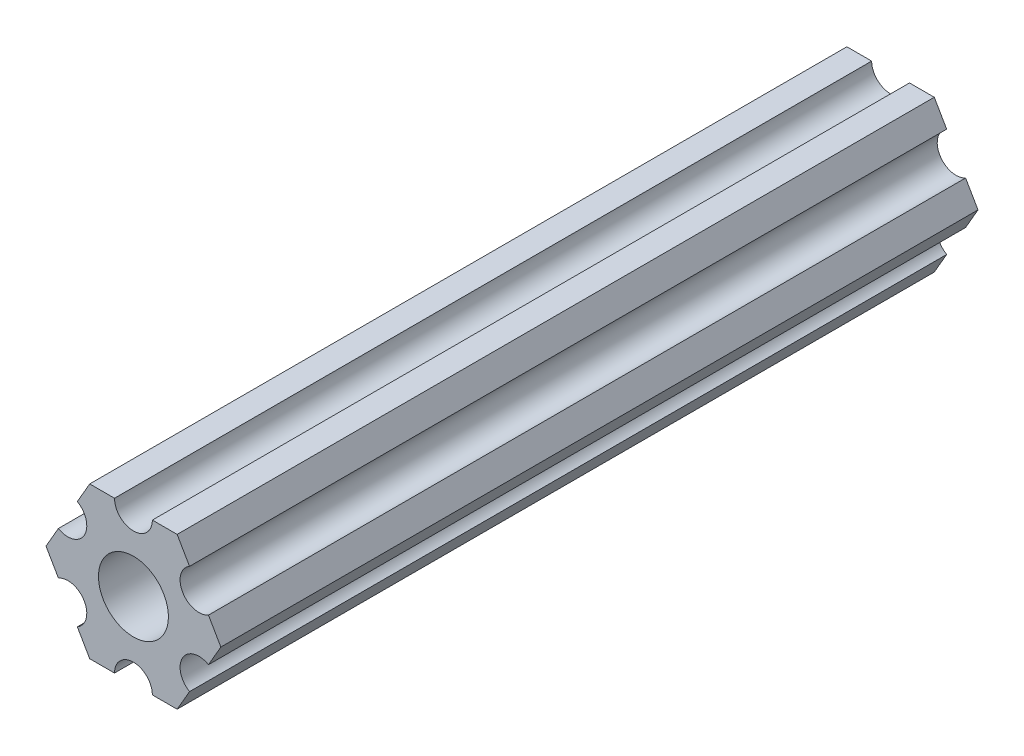
ISO-10303-21;
HEADER;
FILE_DESCRIPTION(('STEP AP214'),'2;1');
FILE_NAME('part.step','',(''),(''),'','','');
FILE_SCHEMA(('AUTOMOTIVE_DESIGN { 1 0 10303 214 1 1 1 1 }'));
ENDSEC;
DATA;
#1=APPLICATION_CONTEXT('core data for automotive mechanical design processes');
#2=APPLICATION_PROTOCOL_DEFINITION('international standard','automotive_design',2000,#1);
#3=PRODUCT_CONTEXT('',#1,'mechanical');
#4=PRODUCT('Part','Part','',(#3));
#5=PRODUCT_RELATED_PRODUCT_CATEGORY('part','',(#4));
#6=PRODUCT_DEFINITION_FORMATION('','',#4);
#7=PRODUCT_DEFINITION_CONTEXT('part definition',#1,'design');
#8=PRODUCT_DEFINITION('design','',#6,#7);
#9=PRODUCT_DEFINITION_SHAPE('','',#8);
#10=(LENGTH_UNIT() NAMED_UNIT(*) SI_UNIT(.MILLI.,.METRE.));
#11=(NAMED_UNIT(*) PLANE_ANGLE_UNIT() SI_UNIT($,.RADIAN.));
#12=(NAMED_UNIT(*) SI_UNIT($,.STERADIAN.) SOLID_ANGLE_UNIT());
#13=UNCERTAINTY_MEASURE_WITH_UNIT(LENGTH_MEASURE(1.E-05),#10,'distance_accuracy_value','');
#14=(GEOMETRIC_REPRESENTATION_CONTEXT(3) GLOBAL_UNCERTAINTY_ASSIGNED_CONTEXT((#13)) GLOBAL_UNIT_ASSIGNED_CONTEXT((#10,
#11,#12)) REPRESENTATION_CONTEXT('',''));
#15=CARTESIAN_POINT('',(0.,0.,0.));
#16=DIRECTION('',(0.,0.,1.));
#17=DIRECTION('',(1.,0.,0.));
#18=AXIS2_PLACEMENT_3D('',#15,#16,#17);
#19=CARTESIAN_POINT('',(6.29301142309098,-1.80018429024546,304.8));
#20=DIRECTION('',(-0.866025434075723,0.499999947533953,0.));
#21=DIRECTION('',(-0.499999947533953,-0.866025434075723,0.));
#22=AXIS2_PLACEMENT_3D('',#19,#20,#21);
#23=PLANE('',#22);
#24=DIRECTION('',(0.,0.,1.));
#25=VECTOR('',#24,1.);
#26=CARTESIAN_POINT('',(6.29301142309098,-1.80018429024547,304.8));
#27=LINE('',#26,#25);
#28=CARTESIAN_POINT('',(6.29301142309098,-1.80018429024547,63.5));
#29=VERTEX_POINT('',#28);
#30=CARTESIAN_POINT('',(6.29301142309098,-1.80018429024547,0.));
#31=VERTEX_POINT('',#30);
#32=EDGE_CURVE('E231',#29,#31,#27,.F.);
#33=ORIENTED_EDGE('',*,*,#32,.T.);
#34=DIRECTION('',(0.500000040068746,0.866025380650736,0.));
#35=VECTOR('',#34,1.);
#36=CARTESIAN_POINT('',(6.29301142309098,-1.80018429024546,0.));
#37=LINE('',#36,#35);
#38=CARTESIAN_POINT('',(7.33234841870827,0.,0.));
#39=VERTEX_POINT('',#38);
#40=EDGE_CURVE('E142',#31,#39,#37,.T.);
#41=ORIENTED_EDGE('',*,*,#40,.T.);
#42=DIRECTION('',(0.,0.,1.));
#43=VECTOR('',#42,1.);
#44=CARTESIAN_POINT('',(7.33234841870827,0.,304.8));
#45=LINE('',#44,#43);
#46=CARTESIAN_POINT('',(7.33234841870827,0.,63.5));
#47=VERTEX_POINT('',#46);
#48=EDGE_CURVE('E146',#39,#47,#45,.T.);
#49=ORIENTED_EDGE('',*,*,#48,.T.);
#50=DIRECTION('',(0.500000040068743,0.866025380650737,0.));
#51=VECTOR('',#50,1.);
#52=CARTESIAN_POINT('',(6.29301142309098,-1.80018429024547,63.5));
#53=LINE('',#52,#51);
#54=EDGE_CURVE('E133',#29,#47,#53,.T.);
#55=ORIENTED_EDGE('',*,*,#54,.F.);
#56=EDGE_LOOP('',(#33,#41,#49,#55));
#57=FACE_BOUND('',#56,.T.);
#58=ADVANCED_FACE('F17',(#57),#23,.F.);
#59=CARTESIAN_POINT('',(7.33234841870827,0.,304.8));
#60=DIRECTION('',(-0.866025373493145,-0.500000052466057,0.));
#61=DIRECTION('',(0.500000052466057,-0.866025373493145,0.));
#62=AXIS2_PLACEMENT_3D('',#59,#60,#61);
#63=PLANE('',#62);
#64=ORIENTED_EDGE('',*,*,#48,.F.);
#65=DIRECTION('',(-0.499999959931286,0.86602542691812,0.));
#66=VECTOR('',#65,1.);
#67=CARTESIAN_POINT('',(7.33234841870827,0.,0.));
#68=LINE('',#67,#66);
#69=CARTESIAN_POINT('',(6.29301120497138,1.80018505273895,0.));
#70=VERTEX_POINT('',#69);
#71=EDGE_CURVE('E225',#39,#70,#68,.T.);
#72=ORIENTED_EDGE('',*,*,#71,.T.);
#73=DIRECTION('',(0.,0.,1.));
#74=VECTOR('',#73,1.);
#75=CARTESIAN_POINT('',(6.29301120497138,1.80018505273895,304.8));
#76=LINE('',#75,#74);
#77=CARTESIAN_POINT('',(6.29301120497138,1.80018505273895,63.5));
#78=VERTEX_POINT('',#77);
#79=EDGE_CURVE('E151',#70,#78,#76,.T.);
#80=ORIENTED_EDGE('',*,*,#79,.T.);
#81=DIRECTION('',(-0.499999959931286,0.86602542691812,0.));
#82=VECTOR('',#81,1.);
#83=CARTESIAN_POINT('',(7.33234841870827,0.,63.5));
#84=LINE('',#83,#82);
#85=EDGE_CURVE('E137',#47,#78,#84,.T.);
#86=ORIENTED_EDGE('',*,*,#85,.F.);
#87=EDGE_LOOP('',(#64,#72,#80,#86));
#88=FACE_BOUND('',#87,.T.);
#89=ADVANCED_FACE('F153',(#88),#63,.F.);
#90=CARTESIAN_POINT('',(5.49926112168156,3.17500033315934,304.8));
#91=DIRECTION('',(0.,0.,1.));
#92=DIRECTION('',(1.,0.,0.));
#93=AXIS2_PLACEMENT_3D('',#90,#91,#92);
#94=CYLINDRICAL_SURFACE('',#93,1.5875);
#95=ORIENTED_EDGE('',*,*,#79,.F.);
#96=CARTESIAN_POINT('',(5.49926112168156,3.17500033315934,0.));
#97=DIRECTION('',(0.,0.,1.));
#98=DIRECTION('',(1.,0.,0.));
#99=AXIS2_PLACEMENT_3D('',#96,#97,#98);
#100=CIRCLE('',#99,1.5875);
#101=CARTESIAN_POINT('',(4.70551103839172,4.54981561357972,0.));
#102=VERTEX_POINT('',#101);
#103=EDGE_CURVE('E222',#70,#102,#100,.F.);
#104=ORIENTED_EDGE('',*,*,#103,.T.);
#105=DIRECTION('',(0.,0.,1.));
#106=VECTOR('',#105,1.);
#107=CARTESIAN_POINT('',(4.70551103839172,4.54981561357972,304.8));
#108=LINE('',#107,#106);
#109=CARTESIAN_POINT('',(4.70551103839172,4.54981561357972,63.5));
#110=VERTEX_POINT('',#109);
#111=EDGE_CURVE('E275',#102,#110,#108,.T.);
#112=ORIENTED_EDGE('',*,*,#111,.T.);
#113=CARTESIAN_POINT('',(5.49926112168156,3.17500033315934,63.5));
#114=DIRECTION('',(0.,0.,1.));
#115=DIRECTION('',(1.,0.,0.));
#116=AXIS2_PLACEMENT_3D('',#113,#114,#115);
#117=CIRCLE('',#116,1.5875);
#118=EDGE_CURVE('E155',#78,#110,#117,.F.);
#119=ORIENTED_EDGE('',*,*,#118,.F.);
#120=EDGE_LOOP('',(#95,#104,#112,#119));
#121=FACE_BOUND('',#120,.T.);
#122=ADVANCED_FACE('F313',(#121),#94,.F.);
#123=CARTESIAN_POINT('',(4.70551103839172,4.54981561357972,304.8));
#124=DIRECTION('',(-0.866025373493151,-0.500000052466046,0.));
#125=DIRECTION('',(0.500000052466046,-0.866025373493151,0.));
#126=AXIS2_PLACEMENT_3D('',#123,#124,#125);
#127=PLANE('',#126);
#128=ORIENTED_EDGE('',*,*,#111,.F.);
#129=DIRECTION('',(-0.500000052466044,0.866025373493152,0.));
#130=VECTOR('',#129,1.);
#131=CARTESIAN_POINT('',(4.70551103839172,4.54981561357972,0.));
#132=LINE('',#131,#130);
#133=CARTESIAN_POINT('',(3.66617382465481,6.35000022210627,0.));
#134=VERTEX_POINT('',#133);
#135=EDGE_CURVE('E217',#102,#134,#132,.T.);
#136=ORIENTED_EDGE('',*,*,#135,.T.);
#137=DIRECTION('',(0.,0.,-1.));
#138=VECTOR('',#137,1.);
#139=CARTESIAN_POINT('',(3.66617382465481,6.35000022210627,304.8));
#140=LINE('',#139,#138);
#141=CARTESIAN_POINT('',(3.66617382465481,6.35000022210627,63.5));
#142=VERTEX_POINT('',#141);
#143=EDGE_CURVE('E127',#134,#142,#140,.F.);
#144=ORIENTED_EDGE('',*,*,#143,.T.);
#145=DIRECTION('',(-0.500000052466043,0.866025373493152,0.));
#146=VECTOR('',#145,1.);
#147=CARTESIAN_POINT('',(4.70551103839172,4.54981561357972,63.5));
#148=LINE('',#147,#146);
#149=EDGE_CURVE('E157',#110,#142,#148,.T.);
#150=ORIENTED_EDGE('',*,*,#149,.F.);
#151=EDGE_LOOP('',(#128,#136,#144,#150));
#152=FACE_BOUND('',#151,.T.);
#153=ADVANCED_FACE('F320',(#152),#127,.F.);
#154=CARTESIAN_POINT('',(3.66617382465481,6.35000022210627,304.8));
#155=DIRECTION('',(0.,-1.,0.));
#156=DIRECTION('',(0.,0.,-1.));
#157=AXIS2_PLACEMENT_3D('',#154,#155,#156);
#158=PLANE('',#157);
#159=ORIENTED_EDGE('',*,*,#143,.F.);
#160=DIRECTION('',(1.,0.,0.));
#161=VECTOR('',#160,1.);
#162=CARTESIAN_POINT('',(5.49926112168156,6.35000022210627,0.));
#163=LINE('',#162,#161);
#164=CARTESIAN_POINT('',(1.58749980765036,6.35000022210627,0.));
#165=VERTEX_POINT('',#164);
#166=EDGE_CURVE('E215',#134,#165,#163,.F.);
#167=ORIENTED_EDGE('',*,*,#166,.T.);
#168=DIRECTION('',(0.,0.,-1.));
#169=VECTOR('',#168,1.);
#170=CARTESIAN_POINT('',(1.58749961530074,6.35000022210627,304.8));
#171=LINE('',#170,#169);
#172=CARTESIAN_POINT('',(1.58749980765036,6.35000022210627,63.5));
#173=VERTEX_POINT('',#172);
#174=EDGE_CURVE('E20',#165,#173,#171,.F.);
#175=ORIENTED_EDGE('',*,*,#174,.T.);
#176=DIRECTION('',(1.,0.,0.));
#177=VECTOR('',#176,1.);
#178=CARTESIAN_POINT('',(2.61875208128583,6.35000022210627,63.5));
#179=LINE('',#178,#177);
#180=EDGE_CURVE('E300',#142,#173,#179,.F.);
#181=ORIENTED_EDGE('',*,*,#180,.F.);
#182=EDGE_LOOP('',(#159,#167,#175,#181));
#183=FACE_BOUND('',#182,.T.);
#184=ADVANCED_FACE('F385',(#183),#158,.F.);
#185=CARTESIAN_POINT('',(0.,6.35,304.8));
#186=DIRECTION('',(0.,0.,1.));
#187=DIRECTION('',(1.,0.,0.));
#188=AXIS2_PLACEMENT_3D('',#185,#186,#187);
#189=CYLINDRICAL_SURFACE('',#188,1.5875);
#190=ORIENTED_EDGE('',*,*,#174,.F.);
#191=CARTESIAN_POINT('',(0.,6.35,0.));
#192=DIRECTION('',(0.,0.,1.));
#193=DIRECTION('',(1.,0.,0.));
#194=AXIS2_PLACEMENT_3D('',#191,#192,#193);
#195=CIRCLE('',#194,1.5875);
#196=CARTESIAN_POINT('',(-1.58750019234963,6.34999990382518,0.));
#197=VERTEX_POINT('',#196);
#198=EDGE_CURVE('E212',#165,#197,#195,.F.);
#199=ORIENTED_EDGE('',*,*,#198,.T.);
#200=DIRECTION('',(0.,0.,-1.));
#201=VECTOR('',#200,1.);
#202=CARTESIAN_POINT('',(-1.58750038469926,6.34999990382518,304.8));
#203=LINE('',#202,#201);
#204=CARTESIAN_POINT('',(-1.58750019234963,6.34999990382518,63.5));
#205=VERTEX_POINT('',#204);
#206=EDGE_CURVE('E269',#197,#205,#203,.F.);
#207=ORIENTED_EDGE('',*,*,#206,.T.);
#208=CARTESIAN_POINT('',(0.,6.35,63.5));
#209=DIRECTION('',(0.,0.,1.));
#210=DIRECTION('',(1.,0.,0.));
#211=AXIS2_PLACEMENT_3D('',#208,#209,#210);
#212=CIRCLE('',#211,1.5875);
#213=EDGE_CURVE('E298',#173,#205,#212,.F.);
#214=ORIENTED_EDGE('',*,*,#213,.F.);
#215=EDGE_LOOP('',(#190,#199,#207,#214));
#216=FACE_BOUND('',#215,.T.);
#217=ADVANCED_FACE('F384',(#216),#189,.F.);
#218=CARTESIAN_POINT('',(-1.58750038469926,6.34999990382518,304.8));
#219=DIRECTION('',(0.,-1.,0.));
#220=DIRECTION('',(0.,0.,-1.));
#221=AXIS2_PLACEMENT_3D('',#218,#219,#220);
#222=PLANE('',#221);
#223=ORIENTED_EDGE('',*,*,#206,.F.);
#224=DIRECTION('',(1.,0.,0.));
#225=VECTOR('',#224,1.);
#226=CARTESIAN_POINT('',(5.49926112168156,6.34999990382519,0.));
#227=LINE('',#226,#225);
#228=CARTESIAN_POINT('',(-3.66617454558244,6.34999986184803,0.));
#229=VERTEX_POINT('',#228);
#230=EDGE_CURVE('E207',#197,#229,#227,.F.);
#231=ORIENTED_EDGE('',*,*,#230,.T.);
#232=DIRECTION('',(0.,0.,1.));
#233=VECTOR('',#232,1.);
#234=CARTESIAN_POINT('',(-3.66617459405349,6.3499997778937,304.8));
#235=LINE('',#234,#233);
#236=CARTESIAN_POINT('',(-3.66617454558245,6.34999986184802,63.5));
#237=VERTEX_POINT('',#236);
#238=EDGE_CURVE('E266',#229,#237,#235,.T.);
#239=ORIENTED_EDGE('',*,*,#238,.T.);
#240=DIRECTION('',(1.,0.,0.));
#241=VECTOR('',#240,1.);
#242=CARTESIAN_POINT('',(2.61875208128583,6.34999990382518,63.5));
#243=LINE('',#242,#241);
#244=EDGE_CURVE('E299',#205,#237,#243,.F.);
#245=ORIENTED_EDGE('',*,*,#244,.F.);
#246=EDGE_LOOP('',(#223,#231,#239,#245));
#247=FACE_BOUND('',#246,.T.);
#248=ADVANCED_FACE('F383',(#247),#222,.F.);
#249=CARTESIAN_POINT('',(-3.66617459405349,6.3499997778937,304.8));
#250=DIRECTION('',(0.866025434075729,-0.499999947533942,0.));
#251=DIRECTION('',(0.499999947533942,0.866025434075729,0.));
#252=AXIS2_PLACEMENT_3D('',#249,#250,#251);
#253=PLANE('',#252);
#254=ORIENTED_EDGE('',*,*,#238,.F.);
#255=DIRECTION('',(-0.499999947533941,-0.86602543407573,0.));
#256=VECTOR('',#255,1.);
#257=CARTESIAN_POINT('',(-3.66617459405349,6.3499997778937,0.));
#258=LINE('',#257,#256);
#259=CARTESIAN_POINT('',(-4.70551158967065,4.54981504343587,0.));
#260=VERTEX_POINT('',#259);
#261=EDGE_CURVE('E204',#229,#260,#258,.T.);
#262=ORIENTED_EDGE('',*,*,#261,.T.);
#263=DIRECTION('',(0.,0.,1.));
#264=VECTOR('',#263,1.);
#265=CARTESIAN_POINT('',(-4.70551158967065,4.54981504343587,304.8));
#266=LINE('',#265,#264);
#267=CARTESIAN_POINT('',(-4.70551158967065,4.54981504343587,63.5));
#268=VERTEX_POINT('',#267);
#269=EDGE_CURVE('E263',#260,#268,#266,.T.);
#270=ORIENTED_EDGE('',*,*,#269,.T.);
#271=DIRECTION('',(-0.499999947533941,-0.86602543407573,0.));
#272=VECTOR('',#271,1.);
#273=CARTESIAN_POINT('',(-3.66617459405349,6.3499997778937,63.5));
#274=LINE('',#273,#272);
#275=EDGE_CURVE('E297',#237,#268,#274,.T.);
#276=ORIENTED_EDGE('',*,*,#275,.F.);
#277=EDGE_LOOP('',(#254,#262,#270,#276));
#278=FACE_BOUND('',#277,.T.);
#279=ADVANCED_FACE('F377',(#278),#253,.F.);
#280=CARTESIAN_POINT('',(-5.49926150638082,3.17499966684067,304.8));
#281=DIRECTION('',(0.,0.,1.));
#282=DIRECTION('',(1.,0.,0.));
#283=AXIS2_PLACEMENT_3D('',#280,#281,#282);
#284=CYLINDRICAL_SURFACE('',#283,1.5875);
#285=ORIENTED_EDGE('',*,*,#269,.F.);
#286=CARTESIAN_POINT('',(-5.49926150638082,3.17499966684067,0.));
#287=DIRECTION('',(0.,0.,1.));
#288=DIRECTION('',(1.,0.,0.));
#289=AXIS2_PLACEMENT_3D('',#286,#287,#288);
#290=CIRCLE('',#289,1.5875);
#291=CARTESIAN_POINT('',(-6.29301142309098,1.80018429024547,0.));
#292=VERTEX_POINT('',#291);
#293=EDGE_CURVE('E201',#260,#292,#290,.F.);
#294=ORIENTED_EDGE('',*,*,#293,.T.);
#295=DIRECTION('',(0.,0.,1.));
#296=VECTOR('',#295,1.);
#297=CARTESIAN_POINT('',(-6.29301142309098,1.80018429024547,304.8));
#298=LINE('',#297,#296);
#299=CARTESIAN_POINT('',(-6.29301142309098,1.80018429024547,63.5));
#300=VERTEX_POINT('',#299);
#301=EDGE_CURVE('E258',#292,#300,#298,.T.);
#302=ORIENTED_EDGE('',*,*,#301,.T.);
#303=CARTESIAN_POINT('',(-5.49926150638082,3.17499966684067,63.5));
#304=DIRECTION('',(0.,0.,1.));
#305=DIRECTION('',(1.,0.,0.));
#306=AXIS2_PLACEMENT_3D('',#303,#304,#305);
#307=CIRCLE('',#306,1.5875);
#308=EDGE_CURVE('E294',#268,#300,#307,.F.);
#309=ORIENTED_EDGE('',*,*,#308,.F.);
#310=EDGE_LOOP('',(#285,#294,#302,#309));
#311=FACE_BOUND('',#310,.T.);
#312=ADVANCED_FACE('F388',(#311),#284,.F.);
#313=CARTESIAN_POINT('',(-6.29301142309098,1.80018429024547,304.8));
#314=DIRECTION('',(0.866025434075724,-0.499999947533952,0.));
#315=DIRECTION('',(0.499999947533952,0.866025434075724,0.));
#316=AXIS2_PLACEMENT_3D('',#313,#314,#315);
#317=PLANE('',#316);
#318=ORIENTED_EDGE('',*,*,#301,.F.);
#319=DIRECTION('',(-0.500000040068744,-0.866025380650737,0.));
#320=VECTOR('',#319,1.);
#321=CARTESIAN_POINT('',(-6.29301142309098,1.80018429024547,0.));
#322=LINE('',#321,#320);
#323=CARTESIAN_POINT('',(-7.33234841870827,0.,0.));
#324=VERTEX_POINT('',#323);
#325=EDGE_CURVE('E196',#292,#324,#322,.T.);
#326=ORIENTED_EDGE('',*,*,#325,.T.);
#327=DIRECTION('',(0.,0.,1.));
#328=VECTOR('',#327,1.);
#329=CARTESIAN_POINT('',(-7.33234841870827,0.,304.8));
#330=LINE('',#329,#328);
#331=CARTESIAN_POINT('',(-7.33234841870827,0.,63.5));
#332=VERTEX_POINT('',#331);
#333=EDGE_CURVE('E255',#324,#332,#330,.T.);
#334=ORIENTED_EDGE('',*,*,#333,.T.);
#335=DIRECTION('',(-0.500000040068743,-0.866025380650738,0.));
#336=VECTOR('',#335,1.);
#337=CARTESIAN_POINT('',(-6.29301142309098,1.80018429024547,63.5));
#338=LINE('',#337,#336);
#339=EDGE_CURVE('E296',#300,#332,#338,.T.);
#340=ORIENTED_EDGE('',*,*,#339,.F.);
#341=EDGE_LOOP('',(#318,#326,#334,#340));
#342=FACE_BOUND('',#341,.T.);
#343=ADVANCED_FACE('F391',(#342),#317,.F.);
#344=CARTESIAN_POINT('',(-7.33234841870827,0.,304.8));
#345=DIRECTION('',(0.866025373493151,0.500000052466045,0.));
#346=DIRECTION('',(-0.500000052466045,0.866025373493151,0.));
#347=AXIS2_PLACEMENT_3D('',#344,#345,#346);
#348=PLANE('',#347);
#349=ORIENTED_EDGE('',*,*,#333,.F.);
#350=DIRECTION('',(0.499999959931273,-0.866025426918128,0.));
#351=VECTOR('',#350,1.);
#352=CARTESIAN_POINT('',(-7.33234841870827,0.,0.));
#353=LINE('',#352,#351);
#354=CARTESIAN_POINT('',(-6.29301120497141,-1.80018505273897,0.));
#355=VERTEX_POINT('',#354);
#356=EDGE_CURVE('E193',#324,#355,#353,.T.);
#357=ORIENTED_EDGE('',*,*,#356,.T.);
#358=DIRECTION('',(0.,0.,1.));
#359=VECTOR('',#358,1.);
#360=CARTESIAN_POINT('',(-6.29301120497141,-1.80018505273897,304.8));
#361=LINE('',#360,#359);
#362=CARTESIAN_POINT('',(-6.29301120497141,-1.80018505273896,63.5));
#363=VERTEX_POINT('',#362);
#364=EDGE_CURVE('E252',#355,#363,#361,.T.);
#365=ORIENTED_EDGE('',*,*,#364,.T.);
#366=DIRECTION('',(0.499999959931275,-0.866025426918127,0.));
#367=VECTOR('',#366,1.);
#368=CARTESIAN_POINT('',(-7.33234841870827,0.,63.5));
#369=LINE('',#368,#367);
#370=EDGE_CURVE('E293',#332,#363,#369,.T.);
#371=ORIENTED_EDGE('',*,*,#370,.F.);
#372=EDGE_LOOP('',(#349,#357,#365,#371));
#373=FACE_BOUND('',#372,.T.);
#374=ADVANCED_FACE('F395',(#373),#348,.F.);
#375=CARTESIAN_POINT('',(-5.49926112168156,-3.17500033315934,304.8));
#376=DIRECTION('',(0.,0.,1.));
#377=DIRECTION('',(1.,0.,0.));
#378=AXIS2_PLACEMENT_3D('',#375,#376,#377);
#379=CYLINDRICAL_SURFACE('',#378,1.5875);
#380=ORIENTED_EDGE('',*,*,#364,.F.);
#381=CARTESIAN_POINT('',(-5.49926112168156,-3.17500033315934,0.));
#382=DIRECTION('',(0.,0.,1.));
#383=DIRECTION('',(1.,0.,0.));
#384=AXIS2_PLACEMENT_3D('',#381,#382,#383);
#385=CIRCLE('',#384,1.5875);
#386=CARTESIAN_POINT('',(-4.70551103839172,-4.54981561357972,0.));
#387=VERTEX_POINT('',#386);
#388=EDGE_CURVE('E190',#355,#387,#385,.F.);
#389=ORIENTED_EDGE('',*,*,#388,.T.);
#390=DIRECTION('',(0.,0.,1.));
#391=VECTOR('',#390,1.);
#392=CARTESIAN_POINT('',(-4.70551103839172,-4.54981561357972,304.8));
#393=LINE('',#392,#391);
#394=CARTESIAN_POINT('',(-4.70551103839172,-4.54981561357972,63.5));
#395=VERTEX_POINT('',#394);
#396=EDGE_CURVE('E247',#387,#395,#393,.T.);
#397=ORIENTED_EDGE('',*,*,#396,.T.);
#398=CARTESIAN_POINT('',(-5.49926112168156,-3.17500033315934,63.5));
#399=DIRECTION('',(0.,0.,1.));
#400=DIRECTION('',(1.,0.,0.));
#401=AXIS2_PLACEMENT_3D('',#398,#399,#400);
#402=CIRCLE('',#401,1.5875);
#403=EDGE_CURVE('E290',#363,#395,#402,.F.);
#404=ORIENTED_EDGE('',*,*,#403,.F.);
#405=EDGE_LOOP('',(#380,#389,#397,#404));
#406=FACE_BOUND('',#405,.T.);
#407=ADVANCED_FACE('F399',(#406),#379,.F.);
#408=CARTESIAN_POINT('',(-4.70551103839172,-4.54981561357972,304.8));
#409=DIRECTION('',(0.866025373493151,0.500000052466045,0.));
#410=DIRECTION('',(-0.500000052466045,0.866025373493151,0.));
#411=AXIS2_PLACEMENT_3D('',#408,#409,#410);
#412=PLANE('',#411);
#413=ORIENTED_EDGE('',*,*,#396,.F.);
#414=DIRECTION('',(0.500000052466041,-0.866025373493153,0.));
#415=VECTOR('',#414,1.);
#416=CARTESIAN_POINT('',(-4.70551103839172,-4.54981561357972,0.));
#417=LINE('',#416,#415);
#418=CARTESIAN_POINT('',(-3.66617382465481,-6.35000022210628,0.));
#419=VERTEX_POINT('',#418);
#420=EDGE_CURVE('E185',#387,#419,#417,.T.);
#421=ORIENTED_EDGE('',*,*,#420,.T.);
#422=DIRECTION('',(0.,0.,1.));
#423=VECTOR('',#422,1.);
#424=CARTESIAN_POINT('',(-3.66617382465481,-6.35000022210628,304.8));
#425=LINE('',#424,#423);
#426=CARTESIAN_POINT('',(-3.66617382465481,-6.35000022210628,63.5));
#427=VERTEX_POINT('',#426);
#428=EDGE_CURVE('E244',#419,#427,#425,.T.);
#429=ORIENTED_EDGE('',*,*,#428,.T.);
#430=DIRECTION('',(0.500000052466042,-0.866025373493153,0.));
#431=VECTOR('',#430,1.);
#432=CARTESIAN_POINT('',(-4.70551103839172,-4.54981561357972,63.5));
#433=LINE('',#432,#431);
#434=EDGE_CURVE('E292',#395,#427,#433,.T.);
#435=ORIENTED_EDGE('',*,*,#434,.F.);
#436=EDGE_LOOP('',(#413,#421,#429,#435));
#437=FACE_BOUND('',#436,.T.);
#438=ADVANCED_FACE('F403',(#437),#412,.F.);
#439=CARTESIAN_POINT('',(-3.66617382465481,-6.35000022210628,304.8));
#440=DIRECTION('',(0.,1.,0.));
#441=DIRECTION('',(0.,0.,1.));
#442=AXIS2_PLACEMENT_3D('',#439,#440,#441);
#443=PLANE('',#442);
#444=ORIENTED_EDGE('',*,*,#428,.F.);
#445=DIRECTION('',(1.,0.,0.));
#446=VECTOR('',#445,1.);
#447=CARTESIAN_POINT('',(5.49926112168156,-6.35000022210628,0.));
#448=LINE('',#447,#446);
#449=CARTESIAN_POINT('',(-1.58749999999999,-6.35000015914056,0.));
#450=VERTEX_POINT('',#449);
#451=EDGE_CURVE('E182',#419,#450,#448,.T.);
#452=ORIENTED_EDGE('',*,*,#451,.T.);
#453=DIRECTION('',(0.,0.,1.));
#454=VECTOR('',#453,1.);
#455=CARTESIAN_POINT('',(-1.5875,-6.35000009617484,304.8));
#456=LINE('',#455,#454);
#457=CARTESIAN_POINT('',(-1.58749999999999,-6.35000015914056,63.5));
#458=VERTEX_POINT('',#457);
#459=EDGE_CURVE('E241',#450,#458,#456,.T.);
#460=ORIENTED_EDGE('',*,*,#459,.T.);
#461=DIRECTION('',(1.,0.,0.));
#462=VECTOR('',#461,1.);
#463=CARTESIAN_POINT('',(2.61875208128583,-6.35000022210628,63.5));
#464=LINE('',#463,#462);
#465=EDGE_CURVE('E289',#427,#458,#464,.T.);
#466=ORIENTED_EDGE('',*,*,#465,.F.);
#467=EDGE_LOOP('',(#444,#452,#460,#466));
#468=FACE_BOUND('',#467,.T.);
#469=ADVANCED_FACE('F406',(#468),#443,.F.);
#470=CARTESIAN_POINT('',(0.,-6.35,304.8));
#471=DIRECTION('',(0.,0.,1.));
#472=DIRECTION('',(1.,0.,0.));
#473=AXIS2_PLACEMENT_3D('',#470,#471,#472);
#474=CYLINDRICAL_SURFACE('',#473,1.5875);
#475=ORIENTED_EDGE('',*,*,#459,.F.);
#476=CARTESIAN_POINT('',(0.,-6.35,0.));
#477=DIRECTION('',(0.,0.,1.));
#478=DIRECTION('',(1.,0.,0.));
#479=AXIS2_PLACEMENT_3D('',#476,#477,#478);
#480=CIRCLE('',#479,1.5875);
#481=CARTESIAN_POINT('',(1.58750019234963,-6.34999990382518,0.));
#482=VERTEX_POINT('',#481);
#483=EDGE_CURVE('E179',#450,#482,#480,.F.);
#484=ORIENTED_EDGE('',*,*,#483,.T.);
#485=DIRECTION('',(0.,0.,1.));
#486=VECTOR('',#485,1.);
#487=CARTESIAN_POINT('',(1.58750038469926,-6.34999990382518,304.8));
#488=LINE('',#487,#486);
#489=CARTESIAN_POINT('',(1.58750019234963,-6.34999990382518,63.5));
#490=VERTEX_POINT('',#489);
#491=EDGE_CURVE('E236',#482,#490,#488,.T.);
#492=ORIENTED_EDGE('',*,*,#491,.T.);
#493=CARTESIAN_POINT('',(0.,-6.35,63.5));
#494=DIRECTION('',(0.,0.,1.));
#495=DIRECTION('',(1.,0.,0.));
#496=AXIS2_PLACEMENT_3D('',#493,#494,#495);
#497=CIRCLE('',#496,1.5875);
#498=EDGE_CURVE('E286',#458,#490,#497,.F.);
#499=ORIENTED_EDGE('',*,*,#498,.F.);
#500=EDGE_LOOP('',(#475,#484,#492,#499));
#501=FACE_BOUND('',#500,.T.);
#502=ADVANCED_FACE('F409',(#501),#474,.F.);
#503=CARTESIAN_POINT('',(1.58750038469926,-6.34999990382518,304.8));
#504=DIRECTION('',(0.,1.,0.));
#505=DIRECTION('',(0.,0.,1.));
#506=AXIS2_PLACEMENT_3D('',#503,#504,#505);
#507=PLANE('',#506);
#508=ORIENTED_EDGE('',*,*,#491,.F.);
#509=DIRECTION('',(1.,0.,0.));
#510=VECTOR('',#509,1.);
#511=CARTESIAN_POINT('',(5.49926112168156,-6.34999990382518,0.));
#512=LINE('',#511,#510);
#513=CARTESIAN_POINT('',(3.66617454558244,-6.34999986184804,0.));
#514=VERTEX_POINT('',#513);
#515=EDGE_CURVE('E174',#482,#514,#512,.T.);
#516=ORIENTED_EDGE('',*,*,#515,.T.);
#517=DIRECTION('',(0.,0.,1.));
#518=VECTOR('',#517,1.);
#519=CARTESIAN_POINT('',(3.66617459405346,-6.34999977789375,304.8));
#520=LINE('',#519,#518);
#521=CARTESIAN_POINT('',(3.66617454584953,-6.34999986184804,63.5));
#522=VERTEX_POINT('',#521);
#523=EDGE_CURVE('E233',#514,#522,#520,.T.);
#524=ORIENTED_EDGE('',*,*,#523,.T.);
#525=DIRECTION('',(1.,0.,0.));
#526=VECTOR('',#525,1.);
#527=CARTESIAN_POINT('',(2.61875208128583,-6.34999990382518,63.5));
#528=LINE('',#527,#526);
#529=EDGE_CURVE('E288',#490,#522,#528,.T.);
#530=ORIENTED_EDGE('',*,*,#529,.F.);
#531=EDGE_LOOP('',(#508,#516,#524,#530));
#532=FACE_BOUND('',#531,.T.);
#533=ADVANCED_FACE('F357',(#532),#507,.F.);
#534=CARTESIAN_POINT('',(3.66617459405346,-6.34999977789375,304.8));
#535=DIRECTION('',(-0.86602543407573,0.499999947533941,0.));
#536=DIRECTION('',(-0.499999947533941,-0.86602543407573,0.));
#537=AXIS2_PLACEMENT_3D('',#534,#535,#536);
#538=PLANE('',#537);
#539=ORIENTED_EDGE('',*,*,#523,.F.);
#540=DIRECTION('',(0.499999947533941,0.86602543407573,0.));
#541=VECTOR('',#540,1.);
#542=CARTESIAN_POINT('',(3.66617459405346,-6.34999977789375,0.));
#543=LINE('',#542,#541);
#544=CARTESIAN_POINT('',(4.70551158967065,-4.54981504343587,0.));
#545=VERTEX_POINT('',#544);
#546=EDGE_CURVE('E171',#514,#545,#543,.T.);
#547=ORIENTED_EDGE('',*,*,#546,.T.);
#548=DIRECTION('',(0.,0.,1.));
#549=VECTOR('',#548,1.);
#550=CARTESIAN_POINT('',(4.70551158967065,-4.54981504343587,304.8));
#551=LINE('',#550,#549);
#552=CARTESIAN_POINT('',(4.70551158967065,-4.54981504343587,63.5));
#553=VERTEX_POINT('',#552);
#554=EDGE_CURVE('E227',#545,#553,#551,.T.);
#555=ORIENTED_EDGE('',*,*,#554,.T.);
#556=DIRECTION('',(0.499999947389385,0.866025434159189,0.));
#557=VECTOR('',#556,1.);
#558=CARTESIAN_POINT('',(3.66617459430746,-6.34999977814775,63.5));
#559=LINE('',#558,#557);
#560=EDGE_CURVE('E35',#522,#553,#559,.T.);
#561=ORIENTED_EDGE('',*,*,#560,.F.);
#562=EDGE_LOOP('',(#539,#547,#555,#561));
#563=FACE_BOUND('',#562,.T.);
#564=ADVANCED_FACE('F361',(#563),#538,.F.);
#565=CARTESIAN_POINT('',(5.49926150638082,-3.17499966684067,304.8));
#566=DIRECTION('',(0.,0.,1.));
#567=DIRECTION('',(1.,0.,0.));
#568=AXIS2_PLACEMENT_3D('',#565,#566,#567);
#569=CYLINDRICAL_SURFACE('',#568,1.5875);
#570=ORIENTED_EDGE('',*,*,#554,.F.);
#571=CARTESIAN_POINT('',(5.49926150638082,-3.17499966684067,0.));
#572=DIRECTION('',(0.,0.,1.));
#573=DIRECTION('',(1.,0.,0.));
#574=AXIS2_PLACEMENT_3D('',#571,#572,#573);
#575=CIRCLE('',#574,1.5875);
#576=EDGE_CURVE('E168',#545,#31,#575,.F.);
#577=ORIENTED_EDGE('',*,*,#576,.T.);
#578=ORIENTED_EDGE('',*,*,#32,.F.);
#579=CARTESIAN_POINT('',(5.49926150638082,-3.17499966684067,63.5));
#580=DIRECTION('',(0.,0.,1.));
#581=DIRECTION('',(1.,0.,0.));
#582=AXIS2_PLACEMENT_3D('',#579,#580,#581);
#583=CIRCLE('',#582,1.5875);
#584=EDGE_CURVE('E140',#553,#29,#583,.F.);
#585=ORIENTED_EDGE('',*,*,#584,.F.);
#586=EDGE_LOOP('',(#570,#577,#578,#585));
#587=FACE_BOUND('',#586,.T.);
#588=ADVANCED_FACE('F363',(#587),#569,.F.);
#589=CARTESIAN_POINT('',(5.49926112168156,3.17500033315934,0.));
#590=DIRECTION('',(0.,0.,1.));
#591=DIRECTION('',(1.,0.,0.));
#592=AXIS2_PLACEMENT_3D('',#589,#590,#591);
#593=PLANE('',#592);
#594=CARTESIAN_POINT('',(0.,0.,0.));
#595=DIRECTION('',(0.,0.,1.));
#596=DIRECTION('',(1.,0.,0.));
#597=AXIS2_PLACEMENT_3D('',#594,#595,#596);
#598=CIRCLE('',#597,2.9337);
#599=CARTESIAN_POINT('',(2.9337,0.,0.));
#600=VERTEX_POINT('',#599);
#601=EDGE_CURVE('E26',#600,#600,#598,.T.);
#602=ORIENTED_EDGE('',*,*,#601,.T.);
#603=EDGE_LOOP('',(#602));
#604=FACE_BOUND('',#603,.T.);
#605=ORIENTED_EDGE('',*,*,#576,.F.);
#606=ORIENTED_EDGE('',*,*,#546,.F.);
#607=ORIENTED_EDGE('',*,*,#515,.F.);
#608=ORIENTED_EDGE('',*,*,#483,.F.);
#609=ORIENTED_EDGE('',*,*,#451,.F.);
#610=ORIENTED_EDGE('',*,*,#420,.F.);
#611=ORIENTED_EDGE('',*,*,#388,.F.);
#612=ORIENTED_EDGE('',*,*,#356,.F.);
#613=ORIENTED_EDGE('',*,*,#325,.F.);
#614=ORIENTED_EDGE('',*,*,#293,.F.);
#615=ORIENTED_EDGE('',*,*,#261,.F.);
#616=ORIENTED_EDGE('',*,*,#230,.F.);
#617=ORIENTED_EDGE('',*,*,#198,.F.);
#618=ORIENTED_EDGE('',*,*,#166,.F.);
#619=ORIENTED_EDGE('',*,*,#135,.F.);
#620=ORIENTED_EDGE('',*,*,#103,.F.);
#621=ORIENTED_EDGE('',*,*,#71,.F.);
#622=ORIENTED_EDGE('',*,*,#40,.F.);
#623=EDGE_LOOP('',(#605,#606,#607,#608,#609,#610,#611,#612,#613,#614,#615,#616,#617,#618,#619,
#620,#621,#622));
#624=FACE_BOUND('',#623,.T.);
#625=ADVANCED_FACE('F318',(#604,#624),#593,.F.);
#626=CARTESIAN_POINT('',(2.61875208128583,49.022,63.5));
#627=DIRECTION('',(0.,0.,1.));
#628=DIRECTION('',(1.,0.,0.));
#629=AXIS2_PLACEMENT_3D('',#626,#627,#628);
#630=PLANE('',#629);
#631=CARTESIAN_POINT('',(0.,0.,63.5));
#632=DIRECTION('',(0.,0.,1.));
#633=DIRECTION('',(1.,0.,0.));
#634=AXIS2_PLACEMENT_3D('',#631,#632,#633);
#635=CIRCLE('',#634,2.9337);
#636=CARTESIAN_POINT('',(2.9337,0.,63.5));
#637=VERTEX_POINT('',#636);
#638=EDGE_CURVE('E11',#637,#637,#635,.F.);
#639=ORIENTED_EDGE('',*,*,#638,.T.);
#640=EDGE_LOOP('',(#639));
#641=FACE_BOUND('',#640,.T.);
#642=ORIENTED_EDGE('',*,*,#560,.T.);
#643=ORIENTED_EDGE('',*,*,#584,.T.);
#644=ORIENTED_EDGE('',*,*,#54,.T.);
#645=ORIENTED_EDGE('',*,*,#85,.T.);
#646=ORIENTED_EDGE('',*,*,#118,.T.);
#647=ORIENTED_EDGE('',*,*,#149,.T.);
#648=ORIENTED_EDGE('',*,*,#180,.T.);
#649=ORIENTED_EDGE('',*,*,#213,.T.);
#650=ORIENTED_EDGE('',*,*,#244,.T.);
#651=ORIENTED_EDGE('',*,*,#275,.T.);
#652=ORIENTED_EDGE('',*,*,#308,.T.);
#653=ORIENTED_EDGE('',*,*,#339,.T.);
#654=ORIENTED_EDGE('',*,*,#370,.T.);
#655=ORIENTED_EDGE('',*,*,#403,.T.);
#656=ORIENTED_EDGE('',*,*,#434,.T.);
#657=ORIENTED_EDGE('',*,*,#465,.T.);
#658=ORIENTED_EDGE('',*,*,#498,.T.);
#659=ORIENTED_EDGE('',*,*,#529,.T.);
#660=EDGE_LOOP('',(#642,#643,#644,#645,#646,#647,#648,#649,#650,#651,#652,#653,#654,#655,#656,
#657,#658,#659));
#661=FACE_BOUND('',#660,.T.);
#662=ADVANCED_FACE('F135',(#641,#661),#630,.T.);
#663=CARTESIAN_POINT('',(0.,0.,304.8));
#664=DIRECTION('',(0.,0.,1.));
#665=DIRECTION('',(1.,0.,0.));
#666=AXIS2_PLACEMENT_3D('',#663,#664,#665);
#667=CYLINDRICAL_SURFACE('',#666,2.9337);
#668=ORIENTED_EDGE('',*,*,#638,.F.);
#669=EDGE_LOOP('',(#668));
#670=FACE_BOUND('',#669,.T.);
#671=ORIENTED_EDGE('',*,*,#601,.F.);
#672=EDGE_LOOP('',(#671));
#673=FACE_BOUND('',#672,.T.);
#674=ADVANCED_FACE('F419',(#670,#673),#667,.F.);
#675=CLOSED_SHELL('',(#58,#89,#122,#153,#184,#217,#248,#279,#312,#343,#374,#407,#438,#469,#502,
#533,#564,#588,#625,#662,#674));
#676=MANIFOLD_SOLID_BREP('B1',#675);
#677=ADVANCED_BREP_SHAPE_REPRESENTATION('',(#18,#676),#14);
#678=SHAPE_DEFINITION_REPRESENTATION(#9,#677);
ENDSEC;
END-ISO-10303-21;
